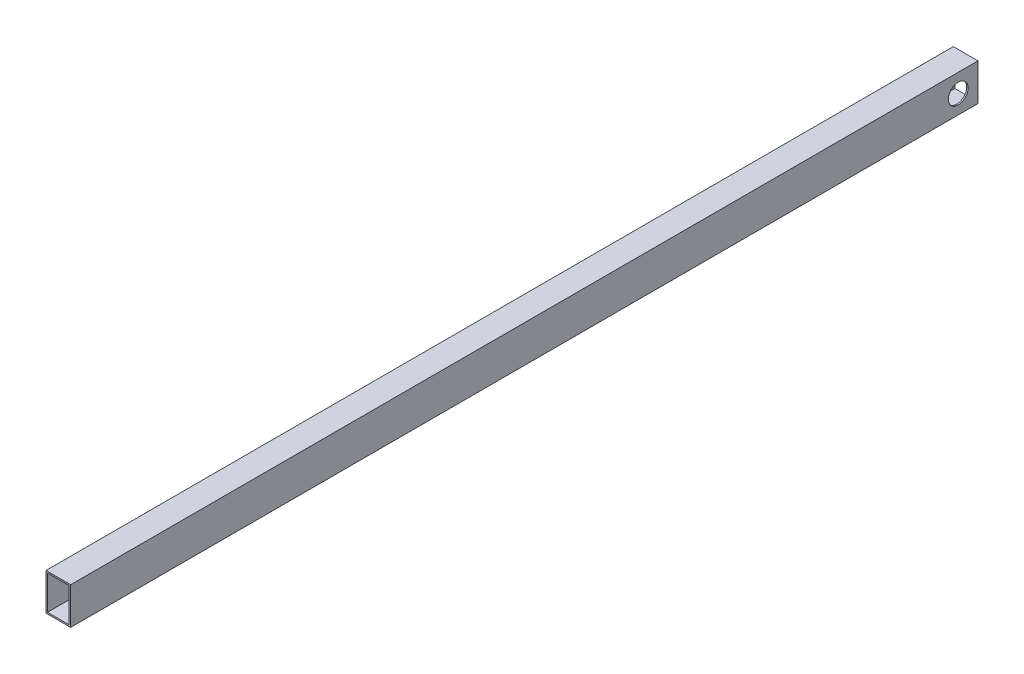
ISO-10303-21;
HEADER;
FILE_DESCRIPTION(('STEP AP214'),'2;1');
FILE_NAME('part.step','',(''),(''),'','','');
FILE_SCHEMA(('AUTOMOTIVE_DESIGN { 1 0 10303 214 1 1 1 1 }'));
ENDSEC;
DATA;
#1=APPLICATION_CONTEXT('core data for automotive mechanical design processes');
#2=APPLICATION_PROTOCOL_DEFINITION('international standard','automotive_design',2000,#1);
#3=PRODUCT_CONTEXT('',#1,'mechanical');
#4=PRODUCT('Part','Part','',(#3));
#5=PRODUCT_RELATED_PRODUCT_CATEGORY('part','',(#4));
#6=PRODUCT_DEFINITION_FORMATION('','',#4);
#7=PRODUCT_DEFINITION_CONTEXT('part definition',#1,'design');
#8=PRODUCT_DEFINITION('design','',#6,#7);
#9=PRODUCT_DEFINITION_SHAPE('','',#8);
#10=(LENGTH_UNIT() NAMED_UNIT(*) SI_UNIT(.MILLI.,.METRE.));
#11=(NAMED_UNIT(*) PLANE_ANGLE_UNIT() SI_UNIT($,.RADIAN.));
#12=(NAMED_UNIT(*) SI_UNIT($,.STERADIAN.) SOLID_ANGLE_UNIT());
#13=UNCERTAINTY_MEASURE_WITH_UNIT(LENGTH_MEASURE(1.E-05),#10,'distance_accuracy_value','');
#14=(GEOMETRIC_REPRESENTATION_CONTEXT(3) GLOBAL_UNCERTAINTY_ASSIGNED_CONTEXT((#13)) GLOBAL_UNIT_ASSIGNED_CONTEXT((#10,
#11,#12)) REPRESENTATION_CONTEXT('',''));
#15=CARTESIAN_POINT('',(0.,0.,0.));
#16=DIRECTION('',(0.,0.,1.));
#17=DIRECTION('',(1.,0.,0.));
#18=AXIS2_PLACEMENT_3D('',#15,#16,#17);
#19=CARTESIAN_POINT('',(-50.,-75.,-80.));
#20=DIRECTION('',(-1.,0.,0.));
#21=DIRECTION('',(0.,-1.,0.));
#22=AXIS2_PLACEMENT_3D('',#19,#20,#21);
#23=PLANE('',#22);
#24=CARTESIAN_POINT('',(-50.,0.,0.));
#25=DIRECTION('',(1.,0.,0.));
#26=DIRECTION('',(0.,0.,-1.));
#27=AXIS2_PLACEMENT_3D('',#24,#25,#26);
#28=CIRCLE('',#27,40.);
#29=CARTESIAN_POINT('',(-50.,0.,-40.));
#30=VERTEX_POINT('',#29);
#31=EDGE_CURVE('E197',#30,#30,#28,.T.);
#32=ORIENTED_EDGE('',*,*,#31,.T.);
#33=EDGE_LOOP('',(#32));
#34=FACE_BOUND('',#33,.T.);
#35=DIRECTION('',(0.,0.,1.));
#36=VECTOR('',#35,1.);
#37=CARTESIAN_POINT('',(-50.,-75.,-80.));
#38=LINE('',#37,#36);
#39=CARTESIAN_POINT('',(-50.,-75.,-80.));
#40=VERTEX_POINT('',#39);
#41=CARTESIAN_POINT('',(-50.,-75.,3600.));
#42=VERTEX_POINT('',#41);
#43=EDGE_CURVE('E163',#40,#42,#38,.T.);
#44=ORIENTED_EDGE('',*,*,#43,.T.);
#45=DIRECTION('',(0.,-1.,0.));
#46=VECTOR('',#45,1.);
#47=CARTESIAN_POINT('',(-50.,-75.,3600.));
#48=LINE('',#47,#46);
#49=CARTESIAN_POINT('',(-50.,74.9999999999999,3600.));
#50=VERTEX_POINT('',#49);
#51=EDGE_CURVE('E131',#50,#42,#48,.T.);
#52=ORIENTED_EDGE('',*,*,#51,.F.);
#53=DIRECTION('',(0.,0.,1.));
#54=VECTOR('',#53,1.);
#55=CARTESIAN_POINT('',(-50.,74.9999999999999,-80.));
#56=LINE('',#55,#54);
#57=CARTESIAN_POINT('',(-50.,74.9999999999999,-80.));
#58=VERTEX_POINT('',#57);
#59=EDGE_CURVE('E11',#58,#50,#56,.T.);
#60=ORIENTED_EDGE('',*,*,#59,.F.);
#61=DIRECTION('',(0.,-1.,0.));
#62=VECTOR('',#61,1.);
#63=CARTESIAN_POINT('',(-50.,-75.,-80.));
#64=LINE('',#63,#62);
#65=EDGE_CURVE('E150',#58,#40,#64,.T.);
#66=ORIENTED_EDGE('',*,*,#65,.T.);
#67=EDGE_LOOP('',(#44,#52,#60,#66));
#68=FACE_BOUND('',#67,.T.);
#69=ADVANCED_FACE('F34',(#34,#68),#23,.T.);
#70=CARTESIAN_POINT('',(-50.,74.9999999999999,-80.));
#71=DIRECTION('',(0.,1.,0.));
#72=DIRECTION('',(-1.,0.,0.));
#73=AXIS2_PLACEMENT_3D('',#70,#71,#72);
#74=PLANE('',#73);
#75=ORIENTED_EDGE('',*,*,#59,.T.);
#76=DIRECTION('',(-1.,0.,0.));
#77=VECTOR('',#76,1.);
#78=CARTESIAN_POINT('',(-50.,74.9999999999999,3600.));
#79=LINE('',#78,#77);
#80=CARTESIAN_POINT('',(50.,75.,3600.));
#81=VERTEX_POINT('',#80);
#82=EDGE_CURVE('E140',#81,#50,#79,.T.);
#83=ORIENTED_EDGE('',*,*,#82,.F.);
#84=DIRECTION('',(0.,0.,1.));
#85=VECTOR('',#84,1.);
#86=CARTESIAN_POINT('',(50.,75.,-80.));
#87=LINE('',#86,#85);
#88=CARTESIAN_POINT('',(50.,75.,-80.));
#89=VERTEX_POINT('',#88);
#90=EDGE_CURVE('E42',#89,#81,#87,.T.);
#91=ORIENTED_EDGE('',*,*,#90,.F.);
#92=DIRECTION('',(-1.,0.,0.));
#93=VECTOR('',#92,1.);
#94=CARTESIAN_POINT('',(-50.,74.9999999999999,-80.));
#95=LINE('',#94,#93);
#96=EDGE_CURVE('E161',#89,#58,#95,.T.);
#97=ORIENTED_EDGE('',*,*,#96,.T.);
#98=EDGE_LOOP('',(#75,#83,#91,#97));
#99=FACE_BOUND('',#98,.T.);
#100=ADVANCED_FACE('F175',(#99),#74,.T.);
#101=CARTESIAN_POINT('',(50.,-75.,-80.));
#102=DIRECTION('',(1.,0.,0.));
#103=DIRECTION('',(0.,1.,0.));
#104=AXIS2_PLACEMENT_3D('',#101,#102,#103);
#105=PLANE('',#104);
#106=CARTESIAN_POINT('',(50.,0.,0.));
#107=DIRECTION('',(1.,0.,0.));
#108=DIRECTION('',(0.,0.,-1.));
#109=AXIS2_PLACEMENT_3D('',#106,#107,#108);
#110=CIRCLE('',#109,40.);
#111=CARTESIAN_POINT('',(50.,0.,-40.));
#112=VERTEX_POINT('',#111);
#113=EDGE_CURVE('E199',#112,#112,#110,.T.);
#114=ORIENTED_EDGE('',*,*,#113,.F.);
#115=EDGE_LOOP('',(#114));
#116=FACE_BOUND('',#115,.T.);
#117=ORIENTED_EDGE('',*,*,#90,.T.);
#118=DIRECTION('',(0.,1.,0.));
#119=VECTOR('',#118,1.);
#120=CARTESIAN_POINT('',(50.,-75.,3600.));
#121=LINE('',#120,#119);
#122=CARTESIAN_POINT('',(50.,-75.,3600.));
#123=VERTEX_POINT('',#122);
#124=EDGE_CURVE('E137',#123,#81,#121,.T.);
#125=ORIENTED_EDGE('',*,*,#124,.F.);
#126=DIRECTION('',(0.,0.,1.));
#127=VECTOR('',#126,1.);
#128=CARTESIAN_POINT('',(50.,-75.,-80.));
#129=LINE('',#128,#127);
#130=CARTESIAN_POINT('',(50.,-75.,-80.));
#131=VERTEX_POINT('',#130);
#132=EDGE_CURVE('E166',#131,#123,#129,.T.);
#133=ORIENTED_EDGE('',*,*,#132,.F.);
#134=DIRECTION('',(0.,1.,0.));
#135=VECTOR('',#134,1.);
#136=CARTESIAN_POINT('',(50.,-75.,-80.));
#137=LINE('',#136,#135);
#138=EDGE_CURVE('E158',#131,#89,#137,.T.);
#139=ORIENTED_EDGE('',*,*,#138,.T.);
#140=EDGE_LOOP('',(#117,#125,#133,#139));
#141=FACE_BOUND('',#140,.T.);
#142=ADVANCED_FACE('F181',(#116,#141),#105,.T.);
#143=CARTESIAN_POINT('',(-50.,-75.,-80.));
#144=DIRECTION('',(0.,-1.,0.));
#145=DIRECTION('',(0.,0.,-1.));
#146=AXIS2_PLACEMENT_3D('',#143,#144,#145);
#147=PLANE('',#146);
#148=ORIENTED_EDGE('',*,*,#132,.T.);
#149=DIRECTION('',(1.,0.,0.));
#150=VECTOR('',#149,1.);
#151=CARTESIAN_POINT('',(-50.,-75.,3600.));
#152=LINE('',#151,#150);
#153=EDGE_CURVE('E134',#42,#123,#152,.T.);
#154=ORIENTED_EDGE('',*,*,#153,.F.);
#155=ORIENTED_EDGE('',*,*,#43,.F.);
#156=DIRECTION('',(1.,0.,0.));
#157=VECTOR('',#156,1.);
#158=CARTESIAN_POINT('',(-50.,-75.,-80.));
#159=LINE('',#158,#157);
#160=EDGE_CURVE('E155',#40,#131,#159,.T.);
#161=ORIENTED_EDGE('',*,*,#160,.T.);
#162=EDGE_LOOP('',(#148,#154,#155,#161));
#163=FACE_BOUND('',#162,.T.);
#164=ADVANCED_FACE('F170',(#163),#147,.T.);
#165=CARTESIAN_POINT('',(0.,0.,-80.));
#166=DIRECTION('',(0.,0.,-1.));
#167=DIRECTION('',(-1.,0.,0.));
#168=AXIS2_PLACEMENT_3D('',#165,#166,#167);
#169=PLANE('',#168);
#170=DIRECTION('',(0.,-1.,0.));
#171=VECTOR('',#170,1.);
#172=CARTESIAN_POINT('',(-44.,-69.,-80.));
#173=LINE('',#172,#171);
#174=CARTESIAN_POINT('',(-44.,69.,-80.));
#175=VERTEX_POINT('',#174);
#176=CARTESIAN_POINT('',(-44.,-69.,-80.));
#177=VERTEX_POINT('',#176);
#178=EDGE_CURVE('E143',#175,#177,#173,.T.);
#179=ORIENTED_EDGE('',*,*,#178,.T.);
#180=DIRECTION('',(1.,0.,0.));
#181=VECTOR('',#180,1.);
#182=CARTESIAN_POINT('',(-44.,-69.,-80.));
#183=LINE('',#182,#181);
#184=CARTESIAN_POINT('',(44.,-69.,-80.));
#185=VERTEX_POINT('',#184);
#186=EDGE_CURVE('E106',#177,#185,#183,.T.);
#187=ORIENTED_EDGE('',*,*,#186,.T.);
#188=DIRECTION('',(0.,1.,0.));
#189=VECTOR('',#188,1.);
#190=CARTESIAN_POINT('',(44.,-69.,-80.));
#191=LINE('',#190,#189);
#192=CARTESIAN_POINT('',(44.,69.,-80.));
#193=VERTEX_POINT('',#192);
#194=EDGE_CURVE('E50',#185,#193,#191,.T.);
#195=ORIENTED_EDGE('',*,*,#194,.T.);
#196=DIRECTION('',(-1.,0.,0.));
#197=VECTOR('',#196,1.);
#198=CARTESIAN_POINT('',(-44.,69.,-80.));
#199=LINE('',#198,#197);
#200=EDGE_CURVE('E111',#193,#175,#199,.T.);
#201=ORIENTED_EDGE('',*,*,#200,.T.);
#202=EDGE_LOOP('',(#179,#187,#195,#201));
#203=FACE_BOUND('',#202,.T.);
#204=ORIENTED_EDGE('',*,*,#65,.F.);
#205=ORIENTED_EDGE('',*,*,#96,.F.);
#206=ORIENTED_EDGE('',*,*,#138,.F.);
#207=ORIENTED_EDGE('',*,*,#160,.F.);
#208=EDGE_LOOP('',(#204,#205,#206,#207));
#209=FACE_BOUND('',#208,.T.);
#210=ADVANCED_FACE('F179',(#203,#209),#169,.T.);
#211=CARTESIAN_POINT('',(-44.,-69.,-80.));
#212=DIRECTION('',(-1.,0.,0.));
#213=DIRECTION('',(0.,0.,1.));
#214=AXIS2_PLACEMENT_3D('',#211,#212,#213);
#215=PLANE('',#214);
#216=CARTESIAN_POINT('',(-44.,0.,0.));
#217=DIRECTION('',(-1.,0.,0.));
#218=DIRECTION('',(0.,0.,1.));
#219=AXIS2_PLACEMENT_3D('',#216,#217,#218);
#220=CIRCLE('',#219,40.);
#221=CARTESIAN_POINT('',(-44.,0.,40.));
#222=VERTEX_POINT('',#221);
#223=EDGE_CURVE('E120',#222,#222,#220,.T.);
#224=ORIENTED_EDGE('',*,*,#223,.T.);
#225=EDGE_LOOP('',(#224));
#226=FACE_BOUND('',#225,.T.);
#227=DIRECTION('',(0.,0.,1.));
#228=VECTOR('',#227,1.);
#229=CARTESIAN_POINT('',(-44.,69.,-80.));
#230=LINE('',#229,#228);
#231=CARTESIAN_POINT('',(-44.,69.,3600.));
#232=VERTEX_POINT('',#231);
#233=EDGE_CURVE('E116',#175,#232,#230,.T.);
#234=ORIENTED_EDGE('',*,*,#233,.T.);
#235=DIRECTION('',(0.,-1.,0.));
#236=VECTOR('',#235,1.);
#237=CARTESIAN_POINT('',(-44.,-69.,3600.));
#238=LINE('',#237,#236);
#239=CARTESIAN_POINT('',(-44.,-69.,3600.));
#240=VERTEX_POINT('',#239);
#241=EDGE_CURVE('E114',#232,#240,#238,.T.);
#242=ORIENTED_EDGE('',*,*,#241,.T.);
#243=DIRECTION('',(0.,0.,1.));
#244=VECTOR('',#243,1.);
#245=CARTESIAN_POINT('',(-44.,-69.,-80.));
#246=LINE('',#245,#244);
#247=EDGE_CURVE('E99',#177,#240,#246,.T.);
#248=ORIENTED_EDGE('',*,*,#247,.F.);
#249=ORIENTED_EDGE('',*,*,#178,.F.);
#250=EDGE_LOOP('',(#234,#242,#248,#249));
#251=FACE_BOUND('',#250,.T.);
#252=ADVANCED_FACE('F115',(#226,#251),#215,.F.);
#253=CARTESIAN_POINT('',(-44.,69.,-80.));
#254=DIRECTION('',(0.,1.,0.));
#255=DIRECTION('',(0.,0.,1.));
#256=AXIS2_PLACEMENT_3D('',#253,#254,#255);
#257=PLANE('',#256);
#258=DIRECTION('',(0.,0.,1.));
#259=VECTOR('',#258,1.);
#260=CARTESIAN_POINT('',(44.,69.,-80.));
#261=LINE('',#260,#259);
#262=CARTESIAN_POINT('',(44.,69.,3600.));
#263=VERTEX_POINT('',#262);
#264=EDGE_CURVE('E151',#193,#263,#261,.T.);
#265=ORIENTED_EDGE('',*,*,#264,.T.);
#266=DIRECTION('',(-1.,0.,0.));
#267=VECTOR('',#266,1.);
#268=CARTESIAN_POINT('',(-44.,69.,3600.));
#269=LINE('',#268,#267);
#270=EDGE_CURVE('E126',#263,#232,#269,.T.);
#271=ORIENTED_EDGE('',*,*,#270,.T.);
#272=ORIENTED_EDGE('',*,*,#233,.F.);
#273=ORIENTED_EDGE('',*,*,#200,.F.);
#274=EDGE_LOOP('',(#265,#271,#272,#273));
#275=FACE_BOUND('',#274,.T.);
#276=ADVANCED_FACE('F219',(#275),#257,.F.);
#277=CARTESIAN_POINT('',(44.,-69.,-80.));
#278=DIRECTION('',(1.,0.,0.));
#279=DIRECTION('',(0.,0.,-1.));
#280=AXIS2_PLACEMENT_3D('',#277,#278,#279);
#281=PLANE('',#280);
#282=CARTESIAN_POINT('',(44.,0.,0.));
#283=DIRECTION('',(1.,0.,0.));
#284=DIRECTION('',(0.,0.,-1.));
#285=AXIS2_PLACEMENT_3D('',#282,#283,#284);
#286=CIRCLE('',#285,40.);
#287=CARTESIAN_POINT('',(44.,0.,-40.));
#288=VERTEX_POINT('',#287);
#289=EDGE_CURVE('E37',#288,#288,#286,.T.);
#290=ORIENTED_EDGE('',*,*,#289,.T.);
#291=EDGE_LOOP('',(#290));
#292=FACE_BOUND('',#291,.T.);
#293=DIRECTION('',(0.,0.,1.));
#294=VECTOR('',#293,1.);
#295=CARTESIAN_POINT('',(44.,-69.,-80.));
#296=LINE('',#295,#294);
#297=CARTESIAN_POINT('',(44.,-69.,3600.));
#298=VERTEX_POINT('',#297);
#299=EDGE_CURVE('E110',#185,#298,#296,.T.);
#300=ORIENTED_EDGE('',*,*,#299,.T.);
#301=DIRECTION('',(0.,1.,0.));
#302=VECTOR('',#301,1.);
#303=CARTESIAN_POINT('',(44.,-69.,3600.));
#304=LINE('',#303,#302);
#305=EDGE_CURVE('E124',#298,#263,#304,.T.);
#306=ORIENTED_EDGE('',*,*,#305,.T.);
#307=ORIENTED_EDGE('',*,*,#264,.F.);
#308=ORIENTED_EDGE('',*,*,#194,.F.);
#309=EDGE_LOOP('',(#300,#306,#307,#308));
#310=FACE_BOUND('',#309,.T.);
#311=ADVANCED_FACE('F222',(#292,#310),#281,.F.);
#312=CARTESIAN_POINT('',(-44.,-69.,-80.));
#313=DIRECTION('',(0.,-1.,0.));
#314=DIRECTION('',(0.,0.,-1.));
#315=AXIS2_PLACEMENT_3D('',#312,#313,#314);
#316=PLANE('',#315);
#317=ORIENTED_EDGE('',*,*,#247,.T.);
#318=DIRECTION('',(1.,0.,0.));
#319=VECTOR('',#318,1.);
#320=CARTESIAN_POINT('',(-44.,-69.,3600.));
#321=LINE('',#320,#319);
#322=EDGE_CURVE('E103',#240,#298,#321,.T.);
#323=ORIENTED_EDGE('',*,*,#322,.T.);
#324=ORIENTED_EDGE('',*,*,#299,.F.);
#325=ORIENTED_EDGE('',*,*,#186,.F.);
#326=EDGE_LOOP('',(#317,#323,#324,#325));
#327=FACE_BOUND('',#326,.T.);
#328=ADVANCED_FACE('F101',(#327),#316,.F.);
#329=CARTESIAN_POINT('',(0.,0.,3600.));
#330=DIRECTION('',(0.,0.,-1.));
#331=DIRECTION('',(-1.,0.,0.));
#332=AXIS2_PLACEMENT_3D('',#329,#330,#331);
#333=PLANE('',#332);
#334=ORIENTED_EDGE('',*,*,#51,.T.);
#335=ORIENTED_EDGE('',*,*,#153,.T.);
#336=ORIENTED_EDGE('',*,*,#124,.T.);
#337=ORIENTED_EDGE('',*,*,#82,.T.);
#338=EDGE_LOOP('',(#334,#335,#336,#337));
#339=FACE_BOUND('',#338,.T.);
#340=ORIENTED_EDGE('',*,*,#241,.F.);
#341=ORIENTED_EDGE('',*,*,#270,.F.);
#342=ORIENTED_EDGE('',*,*,#305,.F.);
#343=ORIENTED_EDGE('',*,*,#322,.F.);
#344=EDGE_LOOP('',(#340,#341,#342,#343));
#345=FACE_BOUND('',#344,.T.);
#346=ADVANCED_FACE('F122',(#339,#345),#333,.F.);
#347=CARTESIAN_POINT('',(-50.,0.,0.));
#348=DIRECTION('',(1.,0.,0.));
#349=DIRECTION('',(0.,0.,-1.));
#350=AXIS2_PLACEMENT_3D('',#347,#348,#349);
#351=CYLINDRICAL_SURFACE('',#350,40.);
#352=ORIENTED_EDGE('',*,*,#113,.T.);
#353=EDGE_LOOP('',(#352));
#354=FACE_BOUND('',#353,.T.);
#355=ORIENTED_EDGE('',*,*,#289,.F.);
#356=EDGE_LOOP('',(#355));
#357=FACE_BOUND('',#356,.T.);
#358=ADVANCED_FACE('F210',(#354,#357),#351,.F.);
#359=ORIENTED_EDGE('',*,*,#31,.F.);
#360=EDGE_LOOP('',(#359));
#361=FACE_BOUND('',#360,.T.);
#362=ORIENTED_EDGE('',*,*,#223,.F.);
#363=EDGE_LOOP('',(#362));
#364=FACE_BOUND('',#363,.T.);
#365=ADVANCED_FACE('F208',(#361,#364),#351,.F.);
#366=CLOSED_SHELL('',(#69,#100,#142,#164,#210,#252,#276,#311,#328,#346,#358,#365));
#367=MANIFOLD_SOLID_BREP('B2',#366);
#368=ADVANCED_BREP_SHAPE_REPRESENTATION('',(#18,#367),#14);
#369=SHAPE_DEFINITION_REPRESENTATION(#9,#368);
ENDSEC;
END-ISO-10303-21;
